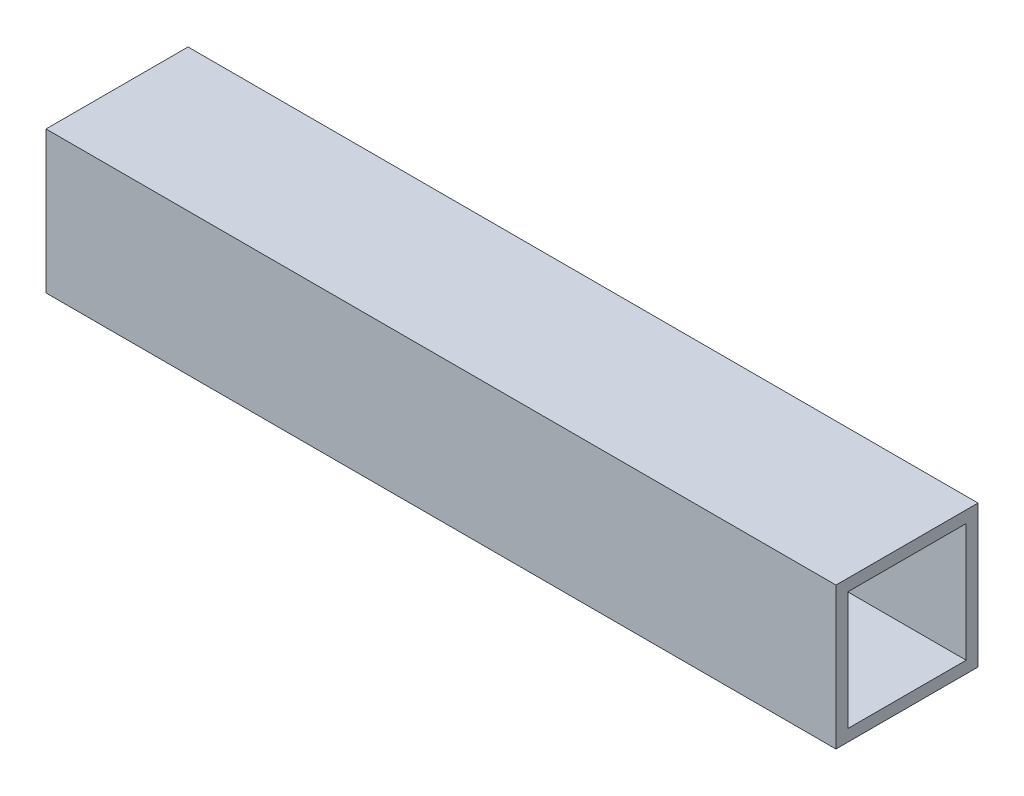
ISO-10303-21;
HEADER;
FILE_DESCRIPTION(('STEP AP214'),'2;1');
FILE_NAME('part.step','',(''),(''),'','','');
FILE_SCHEMA(('AUTOMOTIVE_DESIGN { 1 0 10303 214 1 1 1 1 }'));
ENDSEC;
DATA;
#1=APPLICATION_CONTEXT('core data for automotive mechanical design processes');
#2=APPLICATION_PROTOCOL_DEFINITION('international standard','automotive_design',2000,#1);
#3=PRODUCT_CONTEXT('',#1,'mechanical');
#4=PRODUCT('Part','Part','',(#3));
#5=PRODUCT_RELATED_PRODUCT_CATEGORY('part','',(#4));
#6=PRODUCT_DEFINITION_FORMATION('','',#4);
#7=PRODUCT_DEFINITION_CONTEXT('part definition',#1,'design');
#8=PRODUCT_DEFINITION('design','',#6,#7);
#9=PRODUCT_DEFINITION_SHAPE('','',#8);
#10=(LENGTH_UNIT() NAMED_UNIT(*) SI_UNIT(.MILLI.,.METRE.));
#11=(NAMED_UNIT(*) PLANE_ANGLE_UNIT() SI_UNIT($,.RADIAN.));
#12=(NAMED_UNIT(*) SI_UNIT($,.STERADIAN.) SOLID_ANGLE_UNIT());
#13=UNCERTAINTY_MEASURE_WITH_UNIT(LENGTH_MEASURE(1.E-05),#10,'distance_accuracy_value','');
#14=(GEOMETRIC_REPRESENTATION_CONTEXT(3) GLOBAL_UNCERTAINTY_ASSIGNED_CONTEXT((#13)) GLOBAL_UNIT_ASSIGNED_CONTEXT((#10,
#11,#12)) REPRESENTATION_CONTEXT('',''));
#15=CARTESIAN_POINT('',(0.,0.,0.));
#16=DIRECTION('',(0.,0.,1.));
#17=DIRECTION('',(1.,0.,0.));
#18=AXIS2_PLACEMENT_3D('',#15,#16,#17);
#19=CARTESIAN_POINT('',(0.,0.,-38.1));
#20=DIRECTION('',(-1.,0.,0.));
#21=DIRECTION('',(0.,0.,1.));
#22=AXIS2_PLACEMENT_3D('',#19,#20,#21);
#23=PLANE('',#22);
#24=DIRECTION('',(0.,0.,1.));
#25=VECTOR('',#24,1.);
#26=CARTESIAN_POINT('',(0.,34.925,-34.925));
#27=LINE('',#26,#25);
#28=CARTESIAN_POINT('',(0.,34.925,-34.925));
#29=VERTEX_POINT('',#28);
#30=CARTESIAN_POINT('',(0.,34.925,-3.17500000000003));
#31=VERTEX_POINT('',#30);
#32=EDGE_CURVE('E104',#29,#31,#27,.T.);
#33=ORIENTED_EDGE('',*,*,#32,.T.);
#34=DIRECTION('',(0.,1.,0.));
#35=VECTOR('',#34,1.);
#36=CARTESIAN_POINT('',(0.,3.17500000000004,-3.17500000000003));
#37=LINE('',#36,#35);
#38=CARTESIAN_POINT('',(0.,3.17500000000004,-3.17500000000003));
#39=VERTEX_POINT('',#38);
#40=EDGE_CURVE('E98',#39,#31,#37,.T.);
#41=ORIENTED_EDGE('',*,*,#40,.F.);
#42=DIRECTION('',(0.,0.,1.));
#43=VECTOR('',#42,1.);
#44=CARTESIAN_POINT('',(0.,3.17500000000004,-34.925));
#45=LINE('',#44,#43);
#46=CARTESIAN_POINT('',(0.,3.17500000000004,-34.925));
#47=VERTEX_POINT('',#46);
#48=EDGE_CURVE('E103',#47,#39,#45,.T.);
#49=ORIENTED_EDGE('',*,*,#48,.F.);
#50=DIRECTION('',(0.,1.,0.));
#51=VECTOR('',#50,1.);
#52=CARTESIAN_POINT('',(0.,3.17500000000004,-34.925));
#53=LINE('',#52,#51);
#54=EDGE_CURVE('E113',#47,#29,#53,.T.);
#55=ORIENTED_EDGE('',*,*,#54,.T.);
#56=EDGE_LOOP('',(#33,#41,#49,#55));
#57=FACE_BOUND('',#56,.T.);
#58=DIRECTION('',(0.,-1.,0.));
#59=VECTOR('',#58,1.);
#60=CARTESIAN_POINT('',(0.,0.,0.));
#61=LINE('',#60,#59);
#62=CARTESIAN_POINT('',(0.,38.1,0.));
#63=VERTEX_POINT('',#62);
#64=CARTESIAN_POINT('',(0.,0.,0.));
#65=VERTEX_POINT('',#64);
#66=EDGE_CURVE('E123',#63,#65,#61,.T.);
#67=ORIENTED_EDGE('',*,*,#66,.F.);
#68=DIRECTION('',(0.,0.,1.));
#69=VECTOR('',#68,1.);
#70=CARTESIAN_POINT('',(0.,38.1,-38.1));
#71=LINE('',#70,#69);
#72=CARTESIAN_POINT('',(0.,38.1,-38.1));
#73=VERTEX_POINT('',#72);
#74=EDGE_CURVE('E152',#73,#63,#71,.T.);
#75=ORIENTED_EDGE('',*,*,#74,.F.);
#76=DIRECTION('',(0.,-1.,0.));
#77=VECTOR('',#76,1.);
#78=CARTESIAN_POINT('',(0.,0.,-38.1));
#79=LINE('',#78,#77);
#80=CARTESIAN_POINT('',(0.,0.,-38.1));
#81=VERTEX_POINT('',#80);
#82=EDGE_CURVE('E128',#73,#81,#79,.T.);
#83=ORIENTED_EDGE('',*,*,#82,.T.);
#84=DIRECTION('',(0.,0.,1.));
#85=VECTOR('',#84,1.);
#86=CARTESIAN_POINT('',(0.,0.,-38.1));
#87=LINE('',#86,#85);
#88=EDGE_CURVE('E141',#81,#65,#87,.T.);
#89=ORIENTED_EDGE('',*,*,#88,.T.);
#90=EDGE_LOOP('',(#67,#75,#83,#89));
#91=FACE_BOUND('',#90,.T.);
#92=ADVANCED_FACE('F38',(#57,#91),#23,.T.);
#93=CARTESIAN_POINT('',(0.,38.1,-38.1));
#94=DIRECTION('',(0.,1.,0.));
#95=DIRECTION('',(0.,0.,1.));
#96=AXIS2_PLACEMENT_3D('',#93,#94,#95);
#97=PLANE('',#96);
#98=DIRECTION('',(-1.,0.,0.));
#99=VECTOR('',#98,1.);
#100=CARTESIAN_POINT('',(0.,38.1,0.));
#101=LINE('',#100,#99);
#102=CARTESIAN_POINT('',(211.9,38.1,0.));
#103=VERTEX_POINT('',#102);
#104=EDGE_CURVE('E132',#103,#63,#101,.T.);
#105=ORIENTED_EDGE('',*,*,#104,.F.);
#106=DIRECTION('',(0.,0.,1.));
#107=VECTOR('',#106,1.);
#108=CARTESIAN_POINT('',(211.9,38.1,-38.1));
#109=LINE('',#108,#107);
#110=CARTESIAN_POINT('',(211.9,38.1,-38.1));
#111=VERTEX_POINT('',#110);
#112=EDGE_CURVE('E155',#111,#103,#109,.T.);
#113=ORIENTED_EDGE('',*,*,#112,.F.);
#114=DIRECTION('',(-1.,0.,0.));
#115=VECTOR('',#114,1.);
#116=CARTESIAN_POINT('',(0.,38.1,-38.1));
#117=LINE('',#116,#115);
#118=EDGE_CURVE('E138',#111,#73,#117,.T.);
#119=ORIENTED_EDGE('',*,*,#118,.T.);
#120=ORIENTED_EDGE('',*,*,#74,.T.);
#121=EDGE_LOOP('',(#105,#113,#119,#120));
#122=FACE_BOUND('',#121,.T.);
#123=ADVANCED_FACE('F180',(#122),#97,.T.);
#124=CARTESIAN_POINT('',(211.9,0.,-38.1));
#125=DIRECTION('',(1.,0.,0.));
#126=DIRECTION('',(0.,0.,-1.));
#127=AXIS2_PLACEMENT_3D('',#124,#125,#126);
#128=PLANE('',#127);
#129=DIRECTION('',(0.,0.,1.));
#130=VECTOR('',#129,1.);
#131=CARTESIAN_POINT('',(211.9,34.925,-38.1));
#132=LINE('',#131,#130);
#133=CARTESIAN_POINT('',(211.9,34.925,-34.925));
#134=VERTEX_POINT('',#133);
#135=CARTESIAN_POINT('',(211.9,34.925,-3.17500000000003));
#136=VERTEX_POINT('',#135);
#137=EDGE_CURVE('E11',#134,#136,#132,.T.);
#138=ORIENTED_EDGE('',*,*,#137,.F.);
#139=DIRECTION('',(0.,1.,0.));
#140=VECTOR('',#139,1.);
#141=CARTESIAN_POINT('',(211.9,0.,-34.925));
#142=LINE('',#141,#140);
#143=CARTESIAN_POINT('',(211.9,3.17500000000004,-34.925));
#144=VERTEX_POINT('',#143);
#145=EDGE_CURVE('E45',#144,#134,#142,.T.);
#146=ORIENTED_EDGE('',*,*,#145,.F.);
#147=DIRECTION('',(0.,0.,1.));
#148=VECTOR('',#147,1.);
#149=CARTESIAN_POINT('',(211.9,3.17500000000004,-38.1));
#150=LINE('',#149,#148);
#151=CARTESIAN_POINT('',(211.9,3.17500000000004,-3.17500000000003));
#152=VERTEX_POINT('',#151);
#153=EDGE_CURVE('E161',#144,#152,#150,.T.);
#154=ORIENTED_EDGE('',*,*,#153,.T.);
#155=DIRECTION('',(0.,1.,0.));
#156=VECTOR('',#155,1.);
#157=CARTESIAN_POINT('',(211.9,0.,-3.17500000000003));
#158=LINE('',#157,#156);
#159=EDGE_CURVE('E154',#152,#136,#158,.T.);
#160=ORIENTED_EDGE('',*,*,#159,.T.);
#161=EDGE_LOOP('',(#138,#146,#154,#160));
#162=FACE_BOUND('',#161,.T.);
#163=DIRECTION('',(0.,1.,0.));
#164=VECTOR('',#163,1.);
#165=CARTESIAN_POINT('',(211.9,0.,0.));
#166=LINE('',#165,#164);
#167=CARTESIAN_POINT('',(211.9,0.,0.));
#168=VERTEX_POINT('',#167);
#169=EDGE_CURVE('E147',#168,#103,#166,.T.);
#170=ORIENTED_EDGE('',*,*,#169,.F.);
#171=DIRECTION('',(0.,0.,1.));
#172=VECTOR('',#171,1.);
#173=CARTESIAN_POINT('',(211.9,0.,-38.1));
#174=LINE('',#173,#172);
#175=CARTESIAN_POINT('',(211.9,0.,-38.1));
#176=VERTEX_POINT('',#175);
#177=EDGE_CURVE('E157',#176,#168,#174,.T.);
#178=ORIENTED_EDGE('',*,*,#177,.F.);
#179=DIRECTION('',(0.,1.,0.));
#180=VECTOR('',#179,1.);
#181=CARTESIAN_POINT('',(211.9,0.,-38.1));
#182=LINE('',#181,#180);
#183=EDGE_CURVE('E135',#176,#111,#182,.T.);
#184=ORIENTED_EDGE('',*,*,#183,.T.);
#185=ORIENTED_EDGE('',*,*,#112,.T.);
#186=EDGE_LOOP('',(#170,#178,#184,#185));
#187=FACE_BOUND('',#186,.T.);
#188=ADVANCED_FACE('F167',(#162,#187),#128,.T.);
#189=CARTESIAN_POINT('',(0.,0.,-38.1));
#190=DIRECTION('',(0.,-1.,0.));
#191=DIRECTION('',(0.,0.,-1.));
#192=AXIS2_PLACEMENT_3D('',#189,#190,#191);
#193=PLANE('',#192);
#194=DIRECTION('',(1.,0.,0.));
#195=VECTOR('',#194,1.);
#196=CARTESIAN_POINT('',(0.,0.,0.));
#197=LINE('',#196,#195);
#198=EDGE_CURVE('E144',#65,#168,#197,.T.);
#199=ORIENTED_EDGE('',*,*,#198,.F.);
#200=ORIENTED_EDGE('',*,*,#88,.F.);
#201=DIRECTION('',(1.,0.,0.));
#202=VECTOR('',#201,1.);
#203=CARTESIAN_POINT('',(0.,0.,-38.1));
#204=LINE('',#203,#202);
#205=EDGE_CURVE('E131',#81,#176,#204,.T.);
#206=ORIENTED_EDGE('',*,*,#205,.T.);
#207=ORIENTED_EDGE('',*,*,#177,.T.);
#208=EDGE_LOOP('',(#199,#200,#206,#207));
#209=FACE_BOUND('',#208,.T.);
#210=ADVANCED_FACE('F189',(#209),#193,.T.);
#211=CARTESIAN_POINT('',(0.,0.,-38.1));
#212=DIRECTION('',(0.,0.,-1.));
#213=DIRECTION('',(-1.,0.,0.));
#214=AXIS2_PLACEMENT_3D('',#211,#212,#213);
#215=PLANE('',#214);
#216=ORIENTED_EDGE('',*,*,#82,.F.);
#217=ORIENTED_EDGE('',*,*,#118,.F.);
#218=ORIENTED_EDGE('',*,*,#183,.F.);
#219=ORIENTED_EDGE('',*,*,#205,.F.);
#220=EDGE_LOOP('',(#216,#217,#218,#219));
#221=FACE_BOUND('',#220,.T.);
#222=ADVANCED_FACE('F196',(#221),#215,.T.);
#223=CARTESIAN_POINT('',(0.,0.,0.));
#224=DIRECTION('',(0.,0.,-1.));
#225=DIRECTION('',(-1.,0.,0.));
#226=AXIS2_PLACEMENT_3D('',#223,#224,#225);
#227=PLANE('',#226);
#228=ORIENTED_EDGE('',*,*,#66,.T.);
#229=ORIENTED_EDGE('',*,*,#198,.T.);
#230=ORIENTED_EDGE('',*,*,#169,.T.);
#231=ORIENTED_EDGE('',*,*,#104,.T.);
#232=EDGE_LOOP('',(#228,#229,#230,#231));
#233=FACE_BOUND('',#232,.T.);
#234=ADVANCED_FACE('F193',(#233),#227,.F.);
#235=CARTESIAN_POINT('',(0.,34.925,-34.925));
#236=DIRECTION('',(0.,1.,0.));
#237=DIRECTION('',(0.,0.,1.));
#238=AXIS2_PLACEMENT_3D('',#235,#236,#237);
#239=PLANE('',#238);
#240=ORIENTED_EDGE('',*,*,#137,.T.);
#241=DIRECTION('',(1.,0.,0.));
#242=VECTOR('',#241,1.);
#243=CARTESIAN_POINT('',(0.,34.925,-3.17500000000003));
#244=LINE('',#243,#242);
#245=EDGE_CURVE('E57',#31,#136,#244,.T.);
#246=ORIENTED_EDGE('',*,*,#245,.F.);
#247=ORIENTED_EDGE('',*,*,#32,.F.);
#248=DIRECTION('',(1.,0.,0.));
#249=VECTOR('',#248,1.);
#250=CARTESIAN_POINT('',(0.,34.925,-34.925));
#251=LINE('',#250,#249);
#252=EDGE_CURVE('E121',#29,#134,#251,.T.);
#253=ORIENTED_EDGE('',*,*,#252,.T.);
#254=EDGE_LOOP('',(#240,#246,#247,#253));
#255=FACE_BOUND('',#254,.T.);
#256=ADVANCED_FACE('F108',(#255),#239,.F.);
#257=CARTESIAN_POINT('',(0.,3.17500000000004,-34.925));
#258=DIRECTION('',(0.,0.,-1.));
#259=DIRECTION('',(0.,1.,0.));
#260=AXIS2_PLACEMENT_3D('',#257,#258,#259);
#261=PLANE('',#260);
#262=ORIENTED_EDGE('',*,*,#145,.T.);
#263=ORIENTED_EDGE('',*,*,#252,.F.);
#264=ORIENTED_EDGE('',*,*,#54,.F.);
#265=DIRECTION('',(1.,0.,0.));
#266=VECTOR('',#265,1.);
#267=CARTESIAN_POINT('',(0.,3.17500000000004,-34.925));
#268=LINE('',#267,#266);
#269=EDGE_CURVE('E124',#47,#144,#268,.T.);
#270=ORIENTED_EDGE('',*,*,#269,.T.);
#271=EDGE_LOOP('',(#262,#263,#264,#270));
#272=FACE_BOUND('',#271,.T.);
#273=ADVANCED_FACE('F165',(#272),#261,.F.);
#274=CARTESIAN_POINT('',(0.,3.17500000000004,-34.925));
#275=DIRECTION('',(0.,1.,0.));
#276=DIRECTION('',(0.,0.,1.));
#277=AXIS2_PLACEMENT_3D('',#274,#275,#276);
#278=PLANE('',#277);
#279=ORIENTED_EDGE('',*,*,#269,.F.);
#280=ORIENTED_EDGE('',*,*,#48,.T.);
#281=DIRECTION('',(1.,0.,0.));
#282=VECTOR('',#281,1.);
#283=CARTESIAN_POINT('',(0.,3.17500000000004,-3.17500000000003));
#284=LINE('',#283,#282);
#285=EDGE_CURVE('E52',#39,#152,#284,.T.);
#286=ORIENTED_EDGE('',*,*,#285,.T.);
#287=ORIENTED_EDGE('',*,*,#153,.F.);
#288=EDGE_LOOP('',(#279,#280,#286,#287));
#289=FACE_BOUND('',#288,.T.);
#290=ADVANCED_FACE('F170',(#289),#278,.T.);
#291=CARTESIAN_POINT('',(0.,3.17500000000004,-3.17500000000003));
#292=DIRECTION('',(0.,0.,-1.));
#293=DIRECTION('',(-1.,0.,0.));
#294=AXIS2_PLACEMENT_3D('',#291,#292,#293);
#295=PLANE('',#294);
#296=ORIENTED_EDGE('',*,*,#285,.F.);
#297=ORIENTED_EDGE('',*,*,#40,.T.);
#298=ORIENTED_EDGE('',*,*,#245,.T.);
#299=ORIENTED_EDGE('',*,*,#159,.F.);
#300=EDGE_LOOP('',(#296,#297,#298,#299));
#301=FACE_BOUND('',#300,.T.);
#302=ADVANCED_FACE('F99',(#301),#295,.T.);
#303=CLOSED_SHELL('',(#92,#123,#188,#210,#222,#234,#256,#273,#290,#302));
#304=MANIFOLD_SOLID_BREP('B2',#303);
#305=ADVANCED_BREP_SHAPE_REPRESENTATION('',(#18,#304),#14);
#306=SHAPE_DEFINITION_REPRESENTATION(#9,#305);
ENDSEC;
END-ISO-10303-21;
